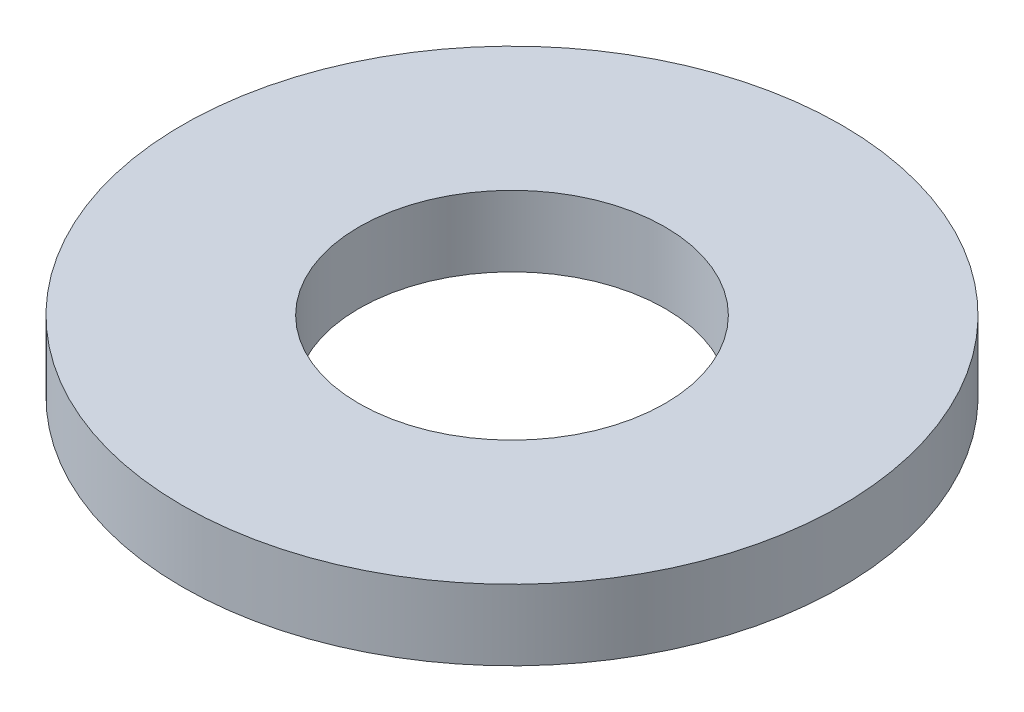
ISO-10303-21;
HEADER;
FILE_DESCRIPTION(('STEP AP214'),'2;1');
FILE_NAME('part.step','',(''),(''),'','','');
FILE_SCHEMA(('AUTOMOTIVE_DESIGN { 1 0 10303 214 1 1 1 1 }'));
ENDSEC;
DATA;
#1=APPLICATION_CONTEXT('core data for automotive mechanical design processes');
#2=APPLICATION_PROTOCOL_DEFINITION('international standard','automotive_design',2000,#1);
#3=PRODUCT_CONTEXT('',#1,'mechanical');
#4=PRODUCT('Part','Part','',(#3));
#5=PRODUCT_RELATED_PRODUCT_CATEGORY('part','',(#4));
#6=PRODUCT_DEFINITION_FORMATION('','',#4);
#7=PRODUCT_DEFINITION_CONTEXT('part definition',#1,'design');
#8=PRODUCT_DEFINITION('design','',#6,#7);
#9=PRODUCT_DEFINITION_SHAPE('','',#8);
#10=(LENGTH_UNIT() NAMED_UNIT(*) SI_UNIT(.MILLI.,.METRE.));
#11=(NAMED_UNIT(*) PLANE_ANGLE_UNIT() SI_UNIT($,.RADIAN.));
#12=(NAMED_UNIT(*) SI_UNIT($,.STERADIAN.) SOLID_ANGLE_UNIT());
#13=UNCERTAINTY_MEASURE_WITH_UNIT(LENGTH_MEASURE(1.E-05),#10,'distance_accuracy_value','');
#14=(GEOMETRIC_REPRESENTATION_CONTEXT(3) GLOBAL_UNCERTAINTY_ASSIGNED_CONTEXT((#13)) GLOBAL_UNIT_ASSIGNED_CONTEXT((#10,
#11,#12)) REPRESENTATION_CONTEXT('',''));
#15=CARTESIAN_POINT('',(0.,0.,0.));
#16=DIRECTION('',(0.,0.,1.));
#17=DIRECTION('',(1.,0.,0.));
#18=AXIS2_PLACEMENT_3D('',#15,#16,#17);
#19=CARTESIAN_POINT('',(0.,15.,0.));
#20=DIRECTION('',(0.,-1.,0.));
#21=DIRECTION('',(0.,0.,-1.));
#22=AXIS2_PLACEMENT_3D('',#19,#20,#21);
#23=CYLINDRICAL_SURFACE('',#22,70.);
#24=CARTESIAN_POINT('',(0.,15.,0.));
#25=DIRECTION('',(0.,1.,0.));
#26=DIRECTION('',(0.,0.,1.));
#27=AXIS2_PLACEMENT_3D('',#24,#25,#26);
#28=CIRCLE('',#27,70.);
#29=CARTESIAN_POINT('',(0.,15.,70.));
#30=VERTEX_POINT('',#29);
#31=EDGE_CURVE('E10',#30,#30,#28,.T.);
#32=ORIENTED_EDGE('',*,*,#31,.F.);
#33=EDGE_LOOP('',(#32));
#34=FACE_BOUND('',#33,.T.);
#35=CARTESIAN_POINT('',(0.,0.,0.));
#36=DIRECTION('',(0.,1.,0.));
#37=DIRECTION('',(0.,0.,1.));
#38=AXIS2_PLACEMENT_3D('',#35,#36,#37);
#39=CIRCLE('',#38,70.);
#40=CARTESIAN_POINT('',(0.,0.,70.));
#41=VERTEX_POINT('',#40);
#42=EDGE_CURVE('E37',#41,#41,#39,.T.);
#43=ORIENTED_EDGE('',*,*,#42,.T.);
#44=EDGE_LOOP('',(#43));
#45=FACE_BOUND('',#44,.T.);
#46=ADVANCED_FACE('F40',(#34,#45),#23,.T.);
#47=CARTESIAN_POINT('',(0.,15.,0.));
#48=DIRECTION('',(0.,1.,0.));
#49=DIRECTION('',(0.,0.,1.));
#50=AXIS2_PLACEMENT_3D('',#47,#48,#49);
#51=PLANE('',#50);
#52=CARTESIAN_POINT('',(0.,15.,0.));
#53=DIRECTION('',(0.,1.,0.));
#54=DIRECTION('',(0.,0.,1.));
#55=AXIS2_PLACEMENT_3D('',#52,#53,#54);
#56=CIRCLE('',#55,32.5);
#57=CARTESIAN_POINT('',(0.,15.,32.5));
#58=VERTEX_POINT('',#57);
#59=EDGE_CURVE('E50',#58,#58,#56,.T.);
#60=ORIENTED_EDGE('',*,*,#59,.F.);
#61=EDGE_LOOP('',(#60));
#62=FACE_BOUND('',#61,.T.);
#63=ORIENTED_EDGE('',*,*,#31,.T.);
#64=EDGE_LOOP('',(#63));
#65=FACE_BOUND('',#64,.T.);
#66=ADVANCED_FACE('F59',(#62,#65),#51,.T.);
#67=CARTESIAN_POINT('',(0.,0.,0.));
#68=DIRECTION('',(0.,1.,0.));
#69=DIRECTION('',(0.,0.,1.));
#70=AXIS2_PLACEMENT_3D('',#67,#68,#69);
#71=PLANE('',#70);
#72=CARTESIAN_POINT('',(0.,0.,0.));
#73=DIRECTION('',(0.,1.,0.));
#74=DIRECTION('',(0.,0.,1.));
#75=AXIS2_PLACEMENT_3D('',#72,#73,#74);
#76=CIRCLE('',#75,32.5);
#77=CARTESIAN_POINT('',(0.,0.,32.5));
#78=VERTEX_POINT('',#77);
#79=EDGE_CURVE('E47',#78,#78,#76,.T.);
#80=ORIENTED_EDGE('',*,*,#79,.T.);
#81=EDGE_LOOP('',(#80));
#82=FACE_BOUND('',#81,.T.);
#83=ORIENTED_EDGE('',*,*,#42,.F.);
#84=EDGE_LOOP('',(#83));
#85=FACE_BOUND('',#84,.T.);
#86=ADVANCED_FACE('F58',(#82,#85),#71,.F.);
#87=CARTESIAN_POINT('',(0.,15.,0.));
#88=DIRECTION('',(0.,-1.,0.));
#89=DIRECTION('',(0.,0.,-1.));
#90=AXIS2_PLACEMENT_3D('',#87,#88,#89);
#91=CYLINDRICAL_SURFACE('',#90,32.5);
#92=ORIENTED_EDGE('',*,*,#59,.T.);
#93=EDGE_LOOP('',(#92));
#94=FACE_BOUND('',#93,.T.);
#95=ORIENTED_EDGE('',*,*,#79,.F.);
#96=EDGE_LOOP('',(#95));
#97=FACE_BOUND('',#96,.T.);
#98=ADVANCED_FACE('F54',(#94,#97),#91,.F.);
#99=CLOSED_SHELL('',(#46,#66,#86,#98));
#100=MANIFOLD_SOLID_BREP('B2',#99);
#101=ADVANCED_BREP_SHAPE_REPRESENTATION('',(#18,#100),#14);
#102=SHAPE_DEFINITION_REPRESENTATION(#9,#101);
ENDSEC;
END-ISO-10303-21;
